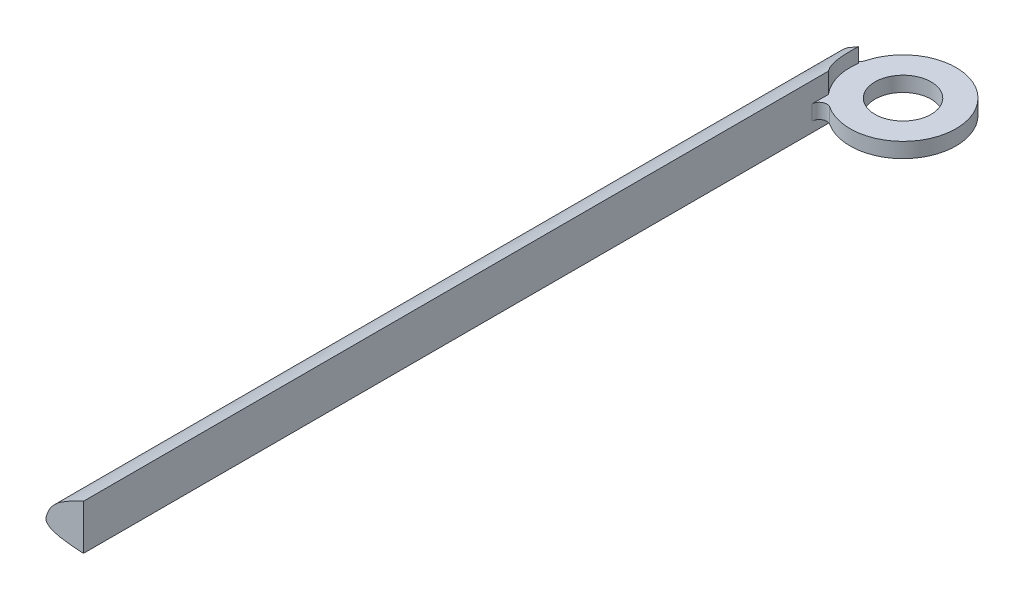
ISO-10303-21;
HEADER;
FILE_DESCRIPTION(('STEP AP214'),'2;1');
FILE_NAME('part.step','',(''),(''),'','','');
FILE_SCHEMA(('AUTOMOTIVE_DESIGN { 1 0 10303 214 1 1 1 1 }'));
ENDSEC;
DATA;
#1=APPLICATION_CONTEXT('core data for automotive mechanical design processes');
#2=APPLICATION_PROTOCOL_DEFINITION('international standard','automotive_design',2000,#1);
#3=PRODUCT_CONTEXT('',#1,'mechanical');
#4=PRODUCT('Part','Part','',(#3));
#5=PRODUCT_RELATED_PRODUCT_CATEGORY('part','',(#4));
#6=PRODUCT_DEFINITION_FORMATION('','',#4);
#7=PRODUCT_DEFINITION_CONTEXT('part definition',#1,'design');
#8=PRODUCT_DEFINITION('design','',#6,#7);
#9=PRODUCT_DEFINITION_SHAPE('','',#8);
#10=(LENGTH_UNIT() NAMED_UNIT(*) SI_UNIT(.MILLI.,.METRE.));
#11=(NAMED_UNIT(*) PLANE_ANGLE_UNIT() SI_UNIT($,.RADIAN.));
#12=(NAMED_UNIT(*) SI_UNIT($,.STERADIAN.) SOLID_ANGLE_UNIT());
#13=UNCERTAINTY_MEASURE_WITH_UNIT(LENGTH_MEASURE(1.E-05),#10,'distance_accuracy_value','');
#14=(GEOMETRIC_REPRESENTATION_CONTEXT(3) GLOBAL_UNCERTAINTY_ASSIGNED_CONTEXT((#13)) GLOBAL_UNIT_ASSIGNED_CONTEXT((#10,
#11,#12)) REPRESENTATION_CONTEXT('',''));
#15=CARTESIAN_POINT('',(0.,0.,0.));
#16=DIRECTION('',(0.,0.,1.));
#17=DIRECTION('',(1.,0.,0.));
#18=AXIS2_PLACEMENT_3D('',#15,#16,#17);
#19=CARTESIAN_POINT('',(12.7,0.,9.9645430734967));
#20=DIRECTION('',(-1.,0.,0.));
#21=DIRECTION('',(0.,0.,1.));
#22=AXIS2_PLACEMENT_3D('',#19,#20,#21);
#23=PLANE('',#22);
#24=DIRECTION('',(0.,1.,0.));
#25=VECTOR('',#24,1.);
#26=CARTESIAN_POINT('',(12.7,-3.39130956318596,24.2953156058815));
#27=LINE('',#26,#25);
#28=CARTESIAN_POINT('',(12.6999999993449,-3.39130956318596,24.2953156051066));
#29=VERTEX_POINT('',#28);
#30=CARTESIAN_POINT('',(12.7,0.,24.2953156058815));
#31=VERTEX_POINT('',#30);
#32=EDGE_CURVE('E201',#29,#31,#27,.T.);
#33=ORIENTED_EDGE('',*,*,#32,.T.);
#34=DIRECTION('',(0.,0.,1.));
#35=VECTOR('',#34,1.);
#36=CARTESIAN_POINT('',(12.7,0.,12.7));
#37=LINE('',#36,#35);
#38=CARTESIAN_POINT('',(12.7,0.,29.8862743545558));
#39=VERTEX_POINT('',#38);
#40=EDGE_CURVE('E60',#31,#39,#37,.T.);
#41=ORIENTED_EDGE('',*,*,#40,.T.);
#42=DIRECTION('',(0.,1.,0.));
#43=VECTOR('',#42,1.);
#44=CARTESIAN_POINT('',(12.7,5.08,29.8862743545558));
#45=LINE('',#44,#43);
#46=CARTESIAN_POINT('',(12.7,5.08,29.8862743545558));
#47=VERTEX_POINT('',#46);
#48=EDGE_CURVE('E281',#39,#47,#45,.T.);
#49=ORIENTED_EDGE('',*,*,#48,.T.);
#50=DIRECTION('',(0.,0.,-1.));
#51=VECTOR('',#50,1.);
#52=CARTESIAN_POINT('',(12.7,5.08,9.9645430734967));
#53=LINE('',#52,#51);
#54=CARTESIAN_POINT('',(12.7,5.08,24.2953156058815));
#55=VERTEX_POINT('',#54);
#56=EDGE_CURVE('E146',#47,#55,#53,.T.);
#57=ORIENTED_EDGE('',*,*,#56,.T.);
#58=DIRECTION('',(0.,-1.,0.));
#59=VECTOR('',#58,1.);
#60=CARTESIAN_POINT('',(12.7,11.9193673893497,24.2953156058815));
#61=LINE('',#60,#59);
#62=CARTESIAN_POINT('',(12.7,11.9193673893497,24.2953156058815));
#63=VERTEX_POINT('',#62);
#64=EDGE_CURVE('E133',#63,#55,#61,.T.);
#65=ORIENTED_EDGE('',*,*,#64,.F.);
#66=DIRECTION('',(0.,0.,1.));
#67=VECTOR('',#66,1.);
#68=CARTESIAN_POINT('',(12.7,11.9193673886914,9.9645430734967));
#69=LINE('',#68,#67);
#70=CARTESIAN_POINT('',(12.7,11.9193673886914,276.664543073497));
#71=VERTEX_POINT('',#70);
#72=EDGE_CURVE('E143',#63,#71,#69,.T.);
#73=ORIENTED_EDGE('',*,*,#72,.T.);
#74=DIRECTION('',(0.,-1.,0.));
#75=VECTOR('',#74,1.);
#76=CARTESIAN_POINT('',(12.7,0.,276.664543073497));
#77=LINE('',#76,#75);
#78=CARTESIAN_POINT('',(12.7,-3.39130956318595,276.664543073497));
#79=VERTEX_POINT('',#78);
#80=EDGE_CURVE('E219',#71,#79,#77,.T.);
#81=ORIENTED_EDGE('',*,*,#80,.T.);
#82=DIRECTION('',(0.,0.,1.));
#83=VECTOR('',#82,1.);
#84=CARTESIAN_POINT('',(12.7,-3.39130956318595,9.9645430734967));
#85=LINE('',#84,#83);
#86=EDGE_CURVE('E247',#29,#79,#85,.T.);
#87=ORIENTED_EDGE('',*,*,#86,.F.);
#88=EDGE_LOOP('',(#33,#41,#49,#57,#65,#73,#81,#87));
#89=FACE_BOUND('',#88,.T.);
#90=ADVANCED_FACE('F44',(#89),#23,.F.);
#91=CARTESIAN_POINT('',(163.3728,0.,9.9645430734967));
#92=CARTESIAN_POINT('',(163.383587059003,0.00751423817285132,9.9645430734967));
#93=CARTESIAN_POINT('',(163.01732505458,0.265748238940606,9.9645430734967));
#94=CARTESIAN_POINT('',(162.609173057159,0.422798752080663,9.9645430734967));
#95=CARTESIAN_POINT('',(161.677409800551,0.893518105061666,9.9645430734967));
#96=CARTESIAN_POINT('',(160.492747402865,1.37853599218307,9.9645430734967));
#97=CARTESIAN_POINT('',(158.934158943173,1.99299349433132,9.9645430734967));
#98=CARTESIAN_POINT('',(157.057898736523,2.65868782569382,9.9645430734967));
#99=CARTESIAN_POINT('',(154.850687721662,3.37645078076449,9.9645430734967));
#100=CARTESIAN_POINT('',(152.333818593458,4.14637497808863,9.9645430734967));
#101=CARTESIAN_POINT('',(149.512288629552,4.96027884299755,9.9645430734967));
#102=CARTESIAN_POINT('',(146.4050128806,5.83699037032611,9.9645430734967));
#103=CARTESIAN_POINT('',(143.014352544334,6.74271883988464,9.9645430734967));
#104=CARTESIAN_POINT('',(139.370608072715,7.72755201916778,9.9645430734967));
#105=CARTESIAN_POINT('',(135.469263436021,8.71313933022112,9.9645430734967));
#106=CARTESIAN_POINT('',(131.34978012743,9.76985404533989,9.9645430734967));
#107=CARTESIAN_POINT('',(127.003368634461,10.8001140879359,9.9645430734967));
#108=CARTESIAN_POINT('',(122.480324632155,11.913090560033,9.9645430734967));
#109=CARTESIAN_POINT('',(117.763343136897,12.9546465407067,9.9645430734967));
#110=CARTESIAN_POINT('',(112.914934001781,14.070673167375,9.9645430734967));
#111=CARTESIAN_POINT('',(107.907963700569,15.0385176744521,9.9645430734967));
#112=CARTESIAN_POINT('',(102.812498431816,16.0556812193166,9.9645430734967));
#113=CARTESIAN_POINT('',(97.6032287639258,16.8789727149063,9.9645430734967));
#114=CARTESIAN_POINT('',(92.3461316631343,17.72359548674,9.9645430734967));
#115=CARTESIAN_POINT('',(87.0232948465702,18.3286664621919,9.9645430734967));
#116=CARTESIAN_POINT('',(81.6955895322473,18.9583990145258,9.9645430734967));
#117=CARTESIAN_POINT('',(76.353194495239,19.3261280897353,9.9645430734967));
#118=CARTESIAN_POINT('',(71.0445122569591,19.7221463408476,9.9645430734967));
#119=CARTESIAN_POINT('',(65.7731773338067,19.8185659051508,9.9645430734967));
#120=CARTESIAN_POINT('',(60.5740112438955,19.9697706351892,9.9645430734967));
#121=CARTESIAN_POINT('',(55.4665475085545,19.8039017338967,9.9645430734967));
#122=CARTESIAN_POINT('',(50.4638042627736,19.7062237947174,9.9645430734967));
#123=CARTESIAN_POINT('',(45.6085392664175,19.2561357479536,9.9645430734967));
#124=CARTESIAN_POINT('',(40.8844110733503,18.8953146570012,9.9645430734967));
#125=CARTESIAN_POINT('',(36.3686592797738,18.1605558467497,9.9645430734967));
#126=CARTESIAN_POINT('',(32.0029387530543,17.5654928060039,9.9645430734967));
#127=CARTESIAN_POINT('',(27.9052262712561,16.6012988542017,9.9645430734967));
#128=CARTESIAN_POINT('',(23.9681817597894,15.8074130893288,9.9645430734967));
#129=CARTESIAN_POINT('',(20.3613553956287,14.6410507890504,9.9645430734967));
#130=CARTESIAN_POINT('',(16.9165744812227,13.678699684883,9.9645430734967));
#131=CARTESIAN_POINT('',(13.8692452701378,12.3524148239362,9.9645430734967));
#132=CARTESIAN_POINT('',(10.966663162502,11.2729140544838,9.9645430734967));
#133=CARTESIAN_POINT('',(8.5276061415999,9.84971764826019,9.9645430734967));
#134=CARTESIAN_POINT('',(6.27996437841128,8.64678560287924,9.9645430734967));
#135=CARTESIAN_POINT('',(4.34224258876067,7.40453424018926,9.9645430734967));
#136=CARTESIAN_POINT('',(2.80617361753247,5.99424744418782,9.9645430734967));
#137=CARTESIAN_POINT('',(1.51674091067302,4.53719147054603,9.9645430734967));
#138=CARTESIAN_POINT('',(0.712524385574345,2.96982774437296,9.9645430734967));
#139=CARTESIAN_POINT('',(0.165588018834602,1.50256591111099,9.9645430734967));
#140=CARTESIAN_POINT('',(-0.175789233061753,0.327544624215155,9.9645430734967));
#141=CARTESIAN_POINT('',(0.206959289608702,-0.498579461354857,9.9645430734967));
#142=CARTESIAN_POINT('',(0.79664848114686,-0.996478044368836,9.9645430734967));
#143=CARTESIAN_POINT('',(1.56272663932993,-1.75151036319057,9.9645430734967));
#144=CARTESIAN_POINT('',(2.90833434344813,-2.0480050450634,9.9645430734967));
#145=CARTESIAN_POINT('',(4.4045940590148,-2.61505597604704,9.9645430734967));
#146=CARTESIAN_POINT('',(6.33424031107069,-2.74845040506197,9.9645430734967));
#147=CARTESIAN_POINT('',(8.51495167423467,-3.15489129161403,9.9645430734967));
#148=CARTESIAN_POINT('',(11.0489505974797,-3.22732703009584,9.9645430734967));
#149=CARTESIAN_POINT('',(13.8584553542713,-3.52127467514997,9.9645430734967));
#150=CARTESIAN_POINT('',(16.9743032298416,-3.53571709132218,9.9645430734967));
#151=CARTESIAN_POINT('',(20.3571900216877,-3.73044274958051,9.9645430734967));
#152=CARTESIAN_POINT('',(24.0084359995763,-3.67387456719054,9.9645430734967));
#153=CARTESIAN_POINT('',(27.9046385930513,-3.75881566774831,9.9645430734967));
#154=CARTESIAN_POINT('',(32.0294409081121,-3.60612028222518,9.9645430734967));
#155=CARTESIAN_POINT('',(36.3707114399823,-3.5627219971114,9.9645430734967));
#156=CARTESIAN_POINT('',(40.9010645293092,-3.30651314562299,9.9645430734967));
#157=CARTESIAN_POINT('',(45.6131065499006,-3.12389238916172,9.9645430734967));
#158=CARTESIAN_POINT('',(50.4713376480519,-2.74598615510798,9.9645430734967));
#159=CARTESIAN_POINT('',(55.4715928923404,-2.40869899451157,9.9645430734967));
#160=CARTESIAN_POINT('',(60.5751894429963,-1.90103929886761,9.9645430734967));
#161=CARTESIAN_POINT('',(65.776667367392,-1.39873920091098,9.9645430734967));
#162=CARTESIAN_POINT('',(71.0405797258692,-0.79262179760565,9.9645430734967));
#163=CARTESIAN_POINT('',(76.3546854690506,-0.177933954517571,9.9645430734967));
#164=CARTESIAN_POINT('',(81.6859884551553,0.504441371035846,9.9645430734967));
#165=CARTESIAN_POINT('',(87.0201887492754,1.16957863430579,9.9645430734967));
#166=CARTESIAN_POINT('',(92.3301818134686,1.82640614131987,9.9645430734967));
#167=CARTESIAN_POINT('',(97.5987035349792,2.40770143258659,9.9645430734967));
#168=CARTESIAN_POINT('',(102.794201193885,2.97695494090187,9.9645430734967));
#169=CARTESIAN_POINT('',(107.904307008512,3.42756384958963,9.9645430734967));
#170=CARTESIAN_POINT('',(112.897874835488,3.84779346579388,9.9645430734967));
#171=CARTESIAN_POINT('',(117.761821538468,4.13786263122034,9.9645430734967));
#172=CARTESIAN_POINT('',(122.46943488994,4.37479073841993,9.9645430734967));
#173=CARTESIAN_POINT('',(127.00364571625,4.49534277188984,9.9645430734967));
#174=CARTESIAN_POINT('',(131.343139297641,4.54052760665104,9.9645430734967));
#175=CARTESIAN_POINT('',(135.470144151123,4.47726296891412,9.9645430734967));
#176=CARTESIAN_POINT('',(139.367410442816,4.32024700938054,9.9645430734967));
#177=CARTESIAN_POINT('',(143.017418886581,4.07128506240523,9.9645430734967));
#178=CARTESIAN_POINT('',(146.404885544076,3.75668779932712,9.9645430734967));
#179=CARTESIAN_POINT('',(149.514262185785,3.37756095345468,9.9645430734967));
#180=CARTESIAN_POINT('',(152.334608133993,2.9605065602643,9.9645430734967));
#181=CARTESIAN_POINT('',(154.852364181883,2.50799530206386,9.9645430734967));
#182=CARTESIAN_POINT('',(157.057311243966,2.02671624361784,9.9645430734967));
#183=CARTESIAN_POINT('',(158.935762762783,1.54985465750666,9.9645430734967));
#184=CARTESIAN_POINT('',(160.492581181518,1.06728896962004,9.9645430734967));
#185=CARTESIAN_POINT('',(161.673940480827,0.666423666198968,9.9645430734967));
#186=CARTESIAN_POINT('',(162.606777317201,0.300087374049791,9.9645430734967));
#187=CARTESIAN_POINT('',(163.008060619899,0.14899970756212,9.9645430734967));
#188=CARTESIAN_POINT('',(163.363659323131,-0.00636737251870985,9.9645430734967));
#189=CARTESIAN_POINT('',(163.3728,0.,9.9645430734967));
#190=B_SPLINE_CURVE_WITH_KNOTS('',3,(#91,#92,#93,#94,#95,#96,#97,#98,#99,#100,#101,#102,#103,
#104,#105,#106,#107,#108,#109,#110,#111,#112,#113,#114,#115,#116,#117,#118,#119,#120,#121,#122,
#123,#124,#125,#126,#127,#128,#129,#130,#131,#132,#133,#134,#135,#136,#137,#138,#139,#140,#141,
#142,#143,#144,#145,#146,#147,#148,#149,#150,#151,#152,#153,#154,#155,#156,#157,#158,#159,#160,
#161,#162,#163,#164,#165,#166,#167,#168,#169,#170,#171,#172,#173,#174,#175,#176,#177,#178,#179,
#180,#181,#182,#183,#184,#185,#186,#187,#188,#189),.UNSPECIFIED.,.T.,.F.,(4,1,1,1,1,1,1,1,1,1,1,
1,1,1,1,1,1,1,1,1,1,1,1,1,1,1,1,1,1,1,1,1,1,1,1,1,1,1,1,1,1,1,1,1,1,1,1,1,1,1,1,1,1,1,1,1,1,1,1,
1,1,1,1,1,1,1,1,1,1,1,1,1,1,1,1,1,1,1,1,1,1,1,1,1,1,1,1,1,1,1,1,1,1,1,1,1,4),(0.,
0.000652375800474001,0.00240344824305293,0.00525656825777616,0.00916576414525399,
0.0140967507887129,0.0200220121070894,0.0268963436763612,0.0347063828713069,0.0434144575923079,
0.0529900197240517,0.0633968094728075,0.0746012542197577,0.0865310302989372,0.099154299734113,
0.112392946202992,0.126224491561968,0.140544888717164,0.155318673337255,0.170431652347923,
0.185859272314617,0.201486855100767,0.21729337680491,0.233167489320596,0.249086100090761,
0.264958726174628,0.280747986632832,0.296380919150158,0.311801213814499,0.326956198280747,
0.34178274714053,0.356247564285208,0.370274835051458,0.383861908178782,0.396887692238994,
0.409401211668324,0.421252505987224,0.432540778472774,0.44306525269204,0.452987148289923,
0.462044499089512,0.470525623352609,0.478015713742355,0.484719935647003,0.490901449374763,
0.496493482376747,0.501934630302492,0.506331603851298,0.510717666514293,0.511954044649899,
0.514195842006017,0.517506907461632,0.521314719070869,0.526107089755545,0.531740962786565,
0.538337761174815,0.545822104103918,0.554208083816506,0.563431264261174,0.573484426850772,
0.584310043394845,0.595866543172384,0.608108296907278,0.620979221659939,0.634441733895477,
0.648424207084819,0.662880137047378,0.677739163464503,0.692957281121996,0.708452452705004,
0.724176515371476,0.740041983978664,0.755990469053507,0.771938352799948,0.787811293886201,
0.803535896442132,0.819040498411977,0.834255057735326,0.849121194519524,0.863570137224621,
0.877552378440428,0.891006015922545,0.903874254768139,0.916114355519662,0.927680383940068,
0.938530909249465,0.948621564264013,0.957908586509766,0.96636362872513,0.97395265018994,
0.980639894713798,0.986402982837544,0.991206560358905,0.995011197109476,0.997773025834374,
0.999447193494769,1.),.UNSPECIFIED.);
#191=DIRECTION('',(0.,0.,1.));
#192=VECTOR('',#191,1.);
#193=SURFACE_OF_LINEAR_EXTRUSION('',#190,#192);
#194=ORIENTED_EDGE('',*,*,#72,.F.);
#195=CARTESIAN_POINT('',(12.6999999505194,11.9193673697668,24.2953155473513));
#196=CARTESIAN_POINT('',(12.6179500550542,11.8867246128226,24.1982599219679));
#197=CARTESIAN_POINT('',(12.536892385023,11.8543305252717,24.1002874250721));
#198=CARTESIAN_POINT('',(12.3768141713411,11.7899404601995,23.9025639701651));
#199=CARTESIAN_POINT('',(12.2977936217405,11.7579444815155,23.8028130173498));
#200=CARTESIAN_POINT('',(12.0637882507752,11.6623728470347,23.5008742752351));
#201=CARTESIAN_POINT('',(11.9119415774658,11.5992458242842,23.2960974292538));
#202=CARTESIAN_POINT('',(11.6169640296919,11.4736579441892,22.8800585920038));
#203=CARTESIAN_POINT('',(11.4738361981,11.4111973256219,22.668794374898));
#204=CARTESIAN_POINT('',(11.1966384268698,11.286689609245,22.2402390981188));
#205=CARTESIAN_POINT('',(11.0625697703199,11.2246425711297,22.0229471908406));
#206=CARTESIAN_POINT('',(10.8029853957612,11.1006445427106,21.581428574126));
#207=CARTESIAN_POINT('',(10.6775257226538,11.0386963541858,21.3571681206556));
#208=CARTESIAN_POINT('',(10.4361552927408,10.916741251319,20.9030881287363));
#209=CARTESIAN_POINT('',(10.3202432290945,10.8567340719843,20.6732693566782));
#210=CARTESIAN_POINT('',(10.0981372601514,10.739848762355,20.2082444651462));
#211=CARTESIAN_POINT('',(9.99194176608081,10.6829701211162,19.9730392343139));
#212=CARTESIAN_POINT('',(9.78947612945665,10.5733217207137,19.4974626244004));
#213=CARTESIAN_POINT('',(9.69320583945963,10.5205519005145,19.2570913221278));
#214=CARTESIAN_POINT('',(9.48052179112395,10.4031704602712,18.6907421212586));
#215=CARTESIAN_POINT('',(9.36805361707046,10.3404554780007,18.3628745880718));
#216=CARTESIAN_POINT('',(9.16185930825928,10.225055783413,17.6995276892244));
#217=CARTESIAN_POINT('',(9.06813514739873,10.1723721275042,17.3640475260296));
#218=CARTESIAN_POINT('',(8.9000675487309,10.0778531100396,16.6867118368189));
#219=CARTESIAN_POINT('',(8.82572623032406,10.0360189348138,16.3448556179942));
#220=CARTESIAN_POINT('',(8.69727796780865,9.96381356701955,15.6577815852282));
#221=CARTESIAN_POINT('',(8.64308086554356,9.9333912931533,15.3125860217719));
#222=CARTESIAN_POINT('',(8.5548616418303,9.88393599853034,14.6188537727116));
#223=CARTESIAN_POINT('',(8.52083776394629,9.86490198622281,14.2703173806717));
#224=CARTESIAN_POINT('',(8.47323350447819,9.83828848252991,13.5715803051382));
#225=CARTESIAN_POINT('',(8.45964159062958,9.8307025295904,13.2213806724794));
#226=CARTESIAN_POINT('',(8.45475673823747,9.82797594588098,12.7089043430011));
#227=CARTESIAN_POINT('',(8.45540953430712,9.82834017598537,12.5466802607088));
#228=CARTESIAN_POINT('',(8.4611076099255,9.83152152153303,12.2223750159377));
#229=CARTESIAN_POINT('',(8.46615154744536,9.83433788754996,12.0602938249368));
#230=CARTESIAN_POINT('',(8.48062213643213,9.8424213350891,11.7364182276708));
#231=CARTESIAN_POINT('',(8.49004813039103,9.84768804894763,11.5746237820355));
#232=CARTESIAN_POINT('',(8.53651383497908,9.87366850006921,10.927791990765));
#233=CARTESIAN_POINT('',(8.59104880541451,9.90419372369418,10.4443507847813));
#234=CARTESIAN_POINT('',(8.66502043820554,9.94571594134705,9.96454307349671));
#235=B_SPLINE_CURVE_WITH_KNOTS('',3,(#195,#196,#197,#198,#199,#200,#201,#202,#203,#204,#205,
#206,#207,#208,#209,#210,#211,#212,#213,#214,#215,#216,#217,#218,#219,#220,#221,#222,#223,#224,
#225,#226,#227,#228,#229,#230,#231,#232,#233,#234),.UNSPECIFIED.,.F.,.F.,(4,2,2,2,2,2,2,2,2,2,2,
2,2,2,2,2,2,2,2,4),(0.,0.393631473360837,0.787261796877514,1.57491470701718,2.3628409511618,
3.15087855964819,3.94363669978717,4.73628614925078,5.52880575868264,6.32131359317409,
7.37733037764669,8.43345831079197,9.4897016769644,10.5411590731783,11.5925249079888,
12.6432971049436,13.1299134581707,13.6163811429858,14.1027758590415,15.5633157298467),.UNSPECIFIED.);
#236=CARTESIAN_POINT('',(8.66502043820553,9.94571594134554,9.9645430734967));
#237=VERTEX_POINT('',#236);
#238=EDGE_CURVE('E129',#63,#237,#235,.T.);
#239=ORIENTED_EDGE('',*,*,#238,.T.);
#240=CARTESIAN_POINT('',(0.,0.851361026245869,9.9645430734967));
#241=VERTEX_POINT('',#240);
#242=EDGE_CURVE('E165',#237,#241,#190,.T.);
#243=ORIENTED_EDGE('',*,*,#242,.T.);
#244=DIRECTION('',(0.,0.,1.));
#245=VECTOR('',#244,1.);
#246=CARTESIAN_POINT('',(0.,0.851361026245869,9.9645430734967));
#247=LINE('',#246,#245);
#248=CARTESIAN_POINT('',(0.,0.851361026245869,276.664543073497));
#249=VERTEX_POINT('',#248);
#250=EDGE_CURVE('E155',#241,#249,#247,.T.);
#251=ORIENTED_EDGE('',*,*,#250,.T.);
#252=CARTESIAN_POINT('',(163.3728,0.,276.664543073497));
#253=CARTESIAN_POINT('',(163.383587059003,0.00751423817285132,276.664543073497));
#254=CARTESIAN_POINT('',(163.01732505458,0.265748238940606,276.664543073497));
#255=CARTESIAN_POINT('',(162.609173057159,0.422798752080663,276.664543073497));
#256=CARTESIAN_POINT('',(161.677409800551,0.893518105061666,276.664543073497));
#257=CARTESIAN_POINT('',(160.492747402865,1.37853599218307,276.664543073497));
#258=CARTESIAN_POINT('',(158.934158943173,1.99299349433132,276.664543073497));
#259=CARTESIAN_POINT('',(157.057898736523,2.65868782569382,276.664543073497));
#260=CARTESIAN_POINT('',(154.850687721662,3.37645078076449,276.664543073497));
#261=CARTESIAN_POINT('',(152.333818593458,4.14637497808863,276.664543073497));
#262=CARTESIAN_POINT('',(149.512288629552,4.96027884299755,276.664543073497));
#263=CARTESIAN_POINT('',(146.4050128806,5.83699037032611,276.664543073497));
#264=CARTESIAN_POINT('',(143.014352544334,6.74271883988464,276.664543073497));
#265=CARTESIAN_POINT('',(139.370608072715,7.72755201916778,276.664543073497));
#266=CARTESIAN_POINT('',(135.469263436021,8.71313933022112,276.664543073497));
#267=CARTESIAN_POINT('',(131.34978012743,9.76985404533989,276.664543073497));
#268=CARTESIAN_POINT('',(127.003368634461,10.8001140879359,276.664543073497));
#269=CARTESIAN_POINT('',(122.480324632155,11.913090560033,276.664543073497));
#270=CARTESIAN_POINT('',(117.763343136897,12.9546465407067,276.664543073497));
#271=CARTESIAN_POINT('',(112.914934001781,14.070673167375,276.664543073497));
#272=CARTESIAN_POINT('',(107.907963700569,15.0385176744521,276.664543073497));
#273=CARTESIAN_POINT('',(102.812498431816,16.0556812193166,276.664543073497));
#274=CARTESIAN_POINT('',(97.6032287639258,16.8789727149063,276.664543073497));
#275=CARTESIAN_POINT('',(92.3461316631343,17.72359548674,276.664543073497));
#276=CARTESIAN_POINT('',(87.0232948465702,18.3286664621919,276.664543073497));
#277=CARTESIAN_POINT('',(81.6955895322473,18.9583990145258,276.664543073497));
#278=CARTESIAN_POINT('',(76.353194495239,19.3261280897353,276.664543073497));
#279=CARTESIAN_POINT('',(71.0445122569591,19.7221463408476,276.664543073497));
#280=CARTESIAN_POINT('',(65.7731773338067,19.8185659051508,276.664543073497));
#281=CARTESIAN_POINT('',(60.5740112438955,19.9697706351892,276.664543073497));
#282=CARTESIAN_POINT('',(55.4665475085545,19.8039017338967,276.664543073497));
#283=CARTESIAN_POINT('',(50.4638042627736,19.7062237947174,276.664543073497));
#284=CARTESIAN_POINT('',(45.6085392664175,19.2561357479536,276.664543073497));
#285=CARTESIAN_POINT('',(40.8844110733503,18.8953146570012,276.664543073497));
#286=CARTESIAN_POINT('',(36.3686592797738,18.1605558467497,276.664543073497));
#287=CARTESIAN_POINT('',(32.0029387530543,17.5654928060039,276.664543073497));
#288=CARTESIAN_POINT('',(27.9052262712561,16.6012988542017,276.664543073497));
#289=CARTESIAN_POINT('',(23.9681817597894,15.8074130893288,276.664543073497));
#290=CARTESIAN_POINT('',(20.3613553956287,14.6410507890504,276.664543073497));
#291=CARTESIAN_POINT('',(16.9165744812227,13.678699684883,276.664543073497));
#292=CARTESIAN_POINT('',(13.8692452701378,12.3524148239362,276.664543073497));
#293=CARTESIAN_POINT('',(10.966663162502,11.2729140544838,276.664543073497));
#294=CARTESIAN_POINT('',(8.5276061415999,9.84971764826019,276.664543073497));
#295=CARTESIAN_POINT('',(6.27996437841128,8.64678560287924,276.664543073497));
#296=CARTESIAN_POINT('',(4.34224258876067,7.40453424018926,276.664543073497));
#297=CARTESIAN_POINT('',(2.80617361753247,5.99424744418782,276.664543073497));
#298=CARTESIAN_POINT('',(1.51674091067302,4.53719147054603,276.664543073497));
#299=CARTESIAN_POINT('',(0.712524385574345,2.96982774437296,276.664543073497));
#300=CARTESIAN_POINT('',(0.165588018834602,1.50256591111099,276.664543073497));
#301=CARTESIAN_POINT('',(-0.175789233061753,0.327544624215155,276.664543073497));
#302=CARTESIAN_POINT('',(0.206959289608702,-0.498579461354857,276.664543073497));
#303=CARTESIAN_POINT('',(0.79664848114686,-0.996478044368836,276.664543073497));
#304=CARTESIAN_POINT('',(1.56272663932993,-1.75151036319057,276.664543073497));
#305=CARTESIAN_POINT('',(2.90833434344813,-2.0480050450634,276.664543073497));
#306=CARTESIAN_POINT('',(4.4045940590148,-2.61505597604704,276.664543073497));
#307=CARTESIAN_POINT('',(6.33424031107069,-2.74845040506197,276.664543073497));
#308=CARTESIAN_POINT('',(8.51495167423467,-3.15489129161403,276.664543073497));
#309=CARTESIAN_POINT('',(11.0489505974797,-3.22732703009584,276.664543073497));
#310=CARTESIAN_POINT('',(13.8584553542713,-3.52127467514997,276.664543073497));
#311=CARTESIAN_POINT('',(16.9743032298416,-3.53571709132218,276.664543073497));
#312=CARTESIAN_POINT('',(20.3571900216877,-3.73044274958051,276.664543073497));
#313=CARTESIAN_POINT('',(24.0084359995763,-3.67387456719054,276.664543073497));
#314=CARTESIAN_POINT('',(27.9046385930513,-3.75881566774831,276.664543073497));
#315=CARTESIAN_POINT('',(32.0294409081121,-3.60612028222518,276.664543073497));
#316=CARTESIAN_POINT('',(36.3707114399823,-3.5627219971114,276.664543073497));
#317=CARTESIAN_POINT('',(40.9010645293092,-3.30651314562299,276.664543073497));
#318=CARTESIAN_POINT('',(45.6131065499006,-3.12389238916172,276.664543073497));
#319=CARTESIAN_POINT('',(50.4713376480519,-2.74598615510798,276.664543073497));
#320=CARTESIAN_POINT('',(55.4715928923404,-2.40869899451157,276.664543073497));
#321=CARTESIAN_POINT('',(60.5751894429963,-1.90103929886761,276.664543073497));
#322=CARTESIAN_POINT('',(65.776667367392,-1.39873920091098,276.664543073497));
#323=CARTESIAN_POINT('',(71.0405797258692,-0.79262179760565,276.664543073497));
#324=CARTESIAN_POINT('',(76.3546854690506,-0.177933954517571,276.664543073497));
#325=CARTESIAN_POINT('',(81.6859884551553,0.504441371035846,276.664543073497));
#326=CARTESIAN_POINT('',(87.0201887492754,1.16957863430579,276.664543073497));
#327=CARTESIAN_POINT('',(92.3301818134686,1.82640614131987,276.664543073497));
#328=CARTESIAN_POINT('',(97.5987035349792,2.40770143258659,276.664543073497));
#329=CARTESIAN_POINT('',(102.794201193885,2.97695494090187,276.664543073497));
#330=CARTESIAN_POINT('',(107.904307008512,3.42756384958963,276.664543073497));
#331=CARTESIAN_POINT('',(112.897874835488,3.84779346579388,276.664543073497));
#332=CARTESIAN_POINT('',(117.761821538468,4.13786263122034,276.664543073497));
#333=CARTESIAN_POINT('',(122.46943488994,4.37479073841993,276.664543073497));
#334=CARTESIAN_POINT('',(127.00364571625,4.49534277188984,276.664543073497));
#335=CARTESIAN_POINT('',(131.343139297641,4.54052760665104,276.664543073497));
#336=CARTESIAN_POINT('',(135.470144151123,4.47726296891412,276.664543073497));
#337=CARTESIAN_POINT('',(139.367410442816,4.32024700938054,276.664543073497));
#338=CARTESIAN_POINT('',(143.017418886581,4.07128506240523,276.664543073497));
#339=CARTESIAN_POINT('',(146.404885544076,3.75668779932712,276.664543073497));
#340=CARTESIAN_POINT('',(149.514262185785,3.37756095345468,276.664543073497));
#341=CARTESIAN_POINT('',(152.334608133993,2.9605065602643,276.664543073497));
#342=CARTESIAN_POINT('',(154.852364181883,2.50799530206386,276.664543073497));
#343=CARTESIAN_POINT('',(157.057311243966,2.02671624361784,276.664543073497));
#344=CARTESIAN_POINT('',(158.935762762783,1.54985465750666,276.664543073497));
#345=CARTESIAN_POINT('',(160.492581181518,1.06728896962004,276.664543073497));
#346=CARTESIAN_POINT('',(161.673940480827,0.666423666198968,276.664543073497));
#347=CARTESIAN_POINT('',(162.606777317201,0.300087374049791,276.664543073497));
#348=CARTESIAN_POINT('',(163.008060619899,0.14899970756212,276.664543073497));
#349=CARTESIAN_POINT('',(163.363659323131,-0.00636737251870985,276.664543073497));
#350=CARTESIAN_POINT('',(163.3728,0.,276.664543073497));
#351=B_SPLINE_CURVE_WITH_KNOTS('',3,(#252,#253,#254,#255,#256,#257,#258,#259,#260,#261,#262,
#263,#264,#265,#266,#267,#268,#269,#270,#271,#272,#273,#274,#275,#276,#277,#278,#279,#280,#281,
#282,#283,#284,#285,#286,#287,#288,#289,#290,#291,#292,#293,#294,#295,#296,#297,#298,#299,#300,
#301,#302,#303,#304,#305,#306,#307,#308,#309,#310,#311,#312,#313,#314,#315,#316,#317,#318,#319,
#320,#321,#322,#323,#324,#325,#326,#327,#328,#329,#330,#331,#332,#333,#334,#335,#336,#337,#338,
#339,#340,#341,#342,#343,#344,#345,#346,#347,#348,#349,#350),.UNSPECIFIED.,.T.,.F.,(4,1,1,1,1,1,
1,1,1,1,1,1,1,1,1,1,1,1,1,1,1,1,1,1,1,1,1,1,1,1,1,1,1,1,1,1,1,1,1,1,1,1,1,1,1,1,1,1,1,1,1,1,1,1,
1,1,1,1,1,1,1,1,1,1,1,1,1,1,1,1,1,1,1,1,1,1,1,1,1,1,1,1,1,1,1,1,1,1,1,1,1,1,1,1,1,1,4),(0.,
0.000652375800474001,0.00240344824305293,0.00525656825777616,0.00916576414525399,
0.0140967507887129,0.0200220121070894,0.0268963436763612,0.0347063828713069,0.0434144575923079,
0.0529900197240517,0.0633968094728075,0.0746012542197577,0.0865310302989372,0.099154299734113,
0.112392946202992,0.126224491561968,0.140544888717164,0.155318673337255,0.170431652347923,
0.185859272314617,0.201486855100767,0.21729337680491,0.233167489320596,0.249086100090761,
0.264958726174628,0.280747986632832,0.296380919150158,0.311801213814499,0.326956198280747,
0.34178274714053,0.356247564285208,0.370274835051458,0.383861908178782,0.396887692238994,
0.409401211668324,0.421252505987224,0.432540778472774,0.44306525269204,0.452987148289923,
0.462044499089512,0.470525623352609,0.478015713742355,0.484719935647003,0.490901449374763,
0.496493482376747,0.501934630302492,0.506331603851298,0.510717666514293,0.511954044649899,
0.514195842006017,0.517506907461632,0.521314719070869,0.526107089755545,0.531740962786565,
0.538337761174815,0.545822104103918,0.554208083816506,0.563431264261174,0.573484426850772,
0.584310043394845,0.595866543172384,0.608108296907278,0.620979221659939,0.634441733895477,
0.648424207084819,0.662880137047378,0.677739163464503,0.692957281121996,0.708452452705004,
0.724176515371476,0.740041983978664,0.755990469053507,0.771938352799948,0.787811293886201,
0.803535896442132,0.819040498411977,0.834255057735326,0.849121194519524,0.863570137224621,
0.877552378440428,0.891006015922545,0.903874254768139,0.916114355519662,0.927680383940068,
0.938530909249465,0.948621564264013,0.957908586509766,0.96636362872513,0.97395265018994,
0.980639894713798,0.986402982837544,0.991206560358905,0.995011197109476,0.997773025834374,
0.999447193494769,1.),.UNSPECIFIED.);
#352=EDGE_CURVE('E152',#71,#249,#351,.T.);
#353=ORIENTED_EDGE('',*,*,#352,.F.);
#354=EDGE_LOOP('',(#194,#239,#243,#251,#353));
#355=FACE_BOUND('',#354,.T.);
#356=ADVANCED_FACE('F150',(#355),#193,.T.);
#357=CARTESIAN_POINT('',(0.,0.,9.9645430734967));
#358=DIRECTION('',(0.,0.,1.));
#359=DIRECTION('',(1.,0.,0.));
#360=AXIS2_PLACEMENT_3D('',#357,#358,#359);
#361=PLANE('',#360);
#362=DIRECTION('',(0.,-1.,0.));
#363=VECTOR('',#362,1.);
#364=CARTESIAN_POINT('',(8.66502043820553,11.9193673893497,9.9645430734967));
#365=LINE('',#364,#363);
#366=CARTESIAN_POINT('',(8.66502043820553,5.08,9.9645430734967));
#367=VERTEX_POINT('',#366);
#368=EDGE_CURVE('E134',#237,#367,#365,.T.);
#369=ORIENTED_EDGE('',*,*,#368,.T.);
#370=DIRECTION('',(-1.,0.,0.));
#371=VECTOR('',#370,1.);
#372=CARTESIAN_POINT('',(0.,5.08,9.9645430734967));
#373=LINE('',#372,#371);
#374=CARTESIAN_POINT('',(6.60588752160476,5.08,9.9645430734967));
#375=VERTEX_POINT('',#374);
#376=EDGE_CURVE('E68',#367,#375,#373,.T.);
#377=ORIENTED_EDGE('',*,*,#376,.T.);
#378=DIRECTION('',(0.,1.,0.));
#379=VECTOR('',#378,1.);
#380=CARTESIAN_POINT('',(6.60588752160476,0.,9.9645430734967));
#381=LINE('',#380,#379);
#382=CARTESIAN_POINT('',(6.60588752160476,0.,9.9645430734967));
#383=VERTEX_POINT('',#382);
#384=EDGE_CURVE('E301',#375,#383,#381,.F.);
#385=ORIENTED_EDGE('',*,*,#384,.T.);
#386=DIRECTION('',(1.,0.,0.));
#387=VECTOR('',#386,1.);
#388=CARTESIAN_POINT('',(26.416,0.,9.9645430734967));
#389=LINE('',#388,#387);
#390=CARTESIAN_POINT('',(8.66502043820553,0.,9.9645430734967));
#391=VERTEX_POINT('',#390);
#392=EDGE_CURVE('E295',#383,#391,#389,.T.);
#393=ORIENTED_EDGE('',*,*,#392,.T.);
#394=DIRECTION('',(0.,1.,0.));
#395=VECTOR('',#394,1.);
#396=CARTESIAN_POINT('',(8.66502043820553,-3.39130956318596,9.9645430734967));
#397=LINE('',#396,#395);
#398=CARTESIAN_POINT('',(8.66502043820553,-3.10795923964405,9.9645430734967));
#399=VERTEX_POINT('',#398);
#400=EDGE_CURVE('E202',#391,#399,#397,.F.);
#401=ORIENTED_EDGE('',*,*,#400,.T.);
#402=CARTESIAN_POINT('',(0.,0.,9.9645430734967));
#403=VERTEX_POINT('',#402);
#404=EDGE_CURVE('E156',#403,#399,#190,.T.);
#405=ORIENTED_EDGE('',*,*,#404,.F.);
#406=DIRECTION('',(0.,1.,0.));
#407=VECTOR('',#406,1.);
#408=CARTESIAN_POINT('',(0.,0.,9.9645430734967));
#409=LINE('',#408,#407);
#410=EDGE_CURVE('E163',#403,#241,#409,.T.);
#411=ORIENTED_EDGE('',*,*,#410,.T.);
#412=ORIENTED_EDGE('',*,*,#242,.F.);
#413=EDGE_LOOP('',(#369,#377,#385,#393,#401,#405,#411,#412));
#414=FACE_BOUND('',#413,.T.);
#415=ADVANCED_FACE('F322',(#414),#361,.F.);
#416=CARTESIAN_POINT('',(12.6999999993449,-3.39130956313331,24.2953156051066));
#417=CARTESIAN_POINT('',(12.59197181293,-3.38262073504254,24.1675305195339));
#418=CARTESIAN_POINT('',(12.4857308395194,-3.37391278970805,24.0382363829237));
#419=CARTESIAN_POINT('',(12.276896530817,-3.35668943947453,23.7767211271205));
#420=CARTESIAN_POINT('',(12.1743032213452,-3.34817403593858,23.6444999872193));
#421=CARTESIAN_POINT('',(11.9728532872739,-3.33156785282765,23.3772426316314));
#422=CARTESIAN_POINT('',(11.8739961341511,-3.32347701312974,23.2422068183381));
#423=CARTESIAN_POINT('',(11.6800816612994,-3.30788803750375,22.9694070398981));
#424=CARTESIAN_POINT('',(11.5850243327273,-3.30038990019624,22.8316430811017));
#425=CARTESIAN_POINT('',(11.3056747899384,-3.27900178404907,22.414426442814));
#426=CARTESIAN_POINT('',(11.1271716680565,-3.26621525631468,22.1310047558042));
#427=CARTESIAN_POINT('',(10.7862347394718,-3.24415099449896,21.5545242293153));
#428=CARTESIAN_POINT('',(10.6238019928342,-3.23487349177291,21.2614647557866));
#429=CARTESIAN_POINT('',(10.3155592345727,-3.217917457591,20.6666806973749));
#430=CARTESIAN_POINT('',(10.1697493477403,-3.21023893813869,20.364956047462));
#431=CARTESIAN_POINT('',(9.89522972374505,-3.19543981951668,19.753819019446));
#432=CARTESIAN_POINT('',(9.76651973132804,-3.18831921201955,19.4444067561797));
#433=CARTESIAN_POINT('',(9.5263316746425,-3.17419154591374,18.8181556698698));
#434=CARTESIAN_POINT('',(9.4148933676433,-3.16718478156911,18.5013015904904));
#435=CARTESIAN_POINT('',(9.20994822286104,-3.15333396593757,17.8618327034878));
#436=CARTESIAN_POINT('',(9.11644191424282,-3.14648991945759,17.5392177261703));
#437=CARTESIAN_POINT('',(8.94765054839221,-3.13329122907783,16.8892154421133));
#438=CARTESIAN_POINT('',(8.87236709535479,-3.1269366282985,16.561827717907));
#439=CARTESIAN_POINT('',(8.74034914287305,-3.11519631431602,15.9037261510274));
#440=CARTESIAN_POINT('',(8.68359239116811,-3.10980944230681,15.5730167939616));
#441=CARTESIAN_POINT('',(8.58868896016275,-3.10047743051969,14.9089522759945));
#442=CARTESIAN_POINT('',(8.55054048001202,-3.09653215123822,14.5755973742951));
#443=CARTESIAN_POINT('',(8.49297897136183,-3.09047198323635,13.907365492829));
#444=CARTESIAN_POINT('',(8.47355946438675,-3.08835646161684,13.5724890796631));
#445=CARTESIAN_POINT('',(8.45533572309083,-3.08636828252711,12.9636628208701));
#446=CARTESIAN_POINT('',(8.45340377913937,-3.08615543458815,12.6898030490535));
#447=CARTESIAN_POINT('',(8.46206137999864,-3.08710258982462,12.1422840832717));
#448=CARTESIAN_POINT('',(8.47265068667424,-3.08826256689101,11.868624885591));
#449=CARTESIAN_POINT('',(8.50630840407089,-3.09187723401381,11.3224256585771));
#450=CARTESIAN_POINT('',(8.52936133589677,-3.09433031803332,11.049884662658));
#451=CARTESIAN_POINT('',(8.58788722783979,-3.10035234657897,10.5060901202653));
#452=CARTESIAN_POINT('',(8.62336296517522,-3.1039215406014,10.2348368754339));
#453=CARTESIAN_POINT('',(8.66502043820554,-3.10795924033791,9.9645430734967));
#454=B_SPLINE_CURVE_WITH_KNOTS('',3,(#416,#417,#418,#419,#420,#421,#422,#423,#424,#425,#426,
#427,#428,#429,#430,#431,#432,#433,#434,#435,#436,#437,#438,#439,#440,#441,#442,#443,#444,#445,
#446,#447,#448,#449,#450,#451,#452,#453),.UNSPECIFIED.,.F.,.F.,(4,2,2,2,2,2,2,2,2,2,2,2,2,2,2,2,
2,2,4),(0.,0.502647224739643,1.00529800678346,1.5078774147707,2.01045565304069,3.01544592671777,
4.02050244936357,5.0255665166905,6.03061557950484,7.03794483795013,8.04530381763535,
9.05275144495078,10.0589845447182,11.0651202450642,12.0709077914644,12.8922298302956,
13.7135362490832,14.5338250016115,15.3542972534976),.UNSPECIFIED.);
#455=EDGE_CURVE('E193',#29,#399,#454,.T.);
#456=ORIENTED_EDGE('',*,*,#455,.F.);
#457=ORIENTED_EDGE('',*,*,#86,.T.);
#458=CARTESIAN_POINT('',(0.,0.,276.664543073497));
#459=VERTEX_POINT('',#458);
#460=EDGE_CURVE('E230',#459,#79,#351,.T.);
#461=ORIENTED_EDGE('',*,*,#460,.F.);
#462=DIRECTION('',(0.,0.,1.));
#463=VECTOR('',#462,1.);
#464=CARTESIAN_POINT('',(0.,0.,9.9645430734967));
#465=LINE('',#464,#463);
#466=EDGE_CURVE('E160',#403,#459,#465,.T.);
#467=ORIENTED_EDGE('',*,*,#466,.F.);
#468=ORIENTED_EDGE('',*,*,#404,.T.);
#469=EDGE_LOOP('',(#456,#457,#461,#467,#468));
#470=FACE_BOUND('',#469,.T.);
#471=ADVANCED_FACE('F177',(#470),#193,.T.);
#472=CARTESIAN_POINT('',(0.,0.,9.9645430734967));
#473=DIRECTION('',(1.,0.,0.));
#474=DIRECTION('',(0.,0.,-1.));
#475=AXIS2_PLACEMENT_3D('',#472,#473,#474);
#476=PLANE('',#475);
#477=ORIENTED_EDGE('',*,*,#466,.T.);
#478=DIRECTION('',(0.,1.,0.));
#479=VECTOR('',#478,1.);
#480=CARTESIAN_POINT('',(0.,0.,276.664543073497));
#481=LINE('',#480,#479);
#482=EDGE_CURVE('E229',#459,#249,#481,.T.);
#483=ORIENTED_EDGE('',*,*,#482,.T.);
#484=ORIENTED_EDGE('',*,*,#250,.F.);
#485=ORIENTED_EDGE('',*,*,#410,.F.);
#486=EDGE_LOOP('',(#477,#483,#484,#485));
#487=FACE_BOUND('',#486,.T.);
#488=ADVANCED_FACE('F255',(#487),#476,.F.);
#489=CARTESIAN_POINT('',(0.,0.,276.664543073497));
#490=DIRECTION('',(0.,0.,1.));
#491=DIRECTION('',(1.,0.,0.));
#492=AXIS2_PLACEMENT_3D('',#489,#490,#491);
#493=PLANE('',#492);
#494=ORIENTED_EDGE('',*,*,#80,.F.);
#495=ORIENTED_EDGE('',*,*,#352,.T.);
#496=ORIENTED_EDGE('',*,*,#482,.F.);
#497=ORIENTED_EDGE('',*,*,#460,.T.);
#498=EDGE_LOOP('',(#494,#495,#496,#497));
#499=FACE_BOUND('',#498,.T.);
#500=ADVANCED_FACE('F265',(#499),#493,.T.);
#501=CARTESIAN_POINT('',(26.416,5.08,12.7));
#502=DIRECTION('',(0.,1.,0.));
#503=DIRECTION('',(0.,0.,1.));
#504=AXIS2_PLACEMENT_3D('',#501,#502,#503);
#505=PLANE('',#504);
#506=CARTESIAN_POINT('',(26.416,5.08,12.7));
#507=DIRECTION('',(0.,1.,0.));
#508=DIRECTION('',(0.,0.,1.));
#509=AXIS2_PLACEMENT_3D('',#506,#507,#508);
#510=CIRCLE('',#509,17.9605122421383);
#511=EDGE_CURVE('E148',#367,#55,#510,.T.);
#512=ORIENTED_EDGE('',*,*,#511,.T.);
#513=ORIENTED_EDGE('',*,*,#56,.F.);
#514=CARTESIAN_POINT('',(15.24,5.08,29.8862743545558));
#515=DIRECTION('',(0.,1.,0.));
#516=DIRECTION('',(0.,0.,1.));
#517=AXIS2_PLACEMENT_3D('',#514,#515,#516);
#518=CIRCLE('',#517,2.54);
#519=CARTESIAN_POINT('',(16.6246990584777,5.08,27.7569062517021));
#520=VERTEX_POINT('',#519);
#521=EDGE_CURVE('E11',#47,#520,#518,.F.);
#522=ORIENTED_EDGE('',*,*,#521,.T.);
#523=CARTESIAN_POINT('',(26.416,5.08,12.7));
#524=DIRECTION('',(0.,1.,0.));
#525=DIRECTION('',(0.,0.,1.));
#526=AXIS2_PLACEMENT_3D('',#523,#524,#525);
#527=CIRCLE('',#526,17.9605122421383);
#528=CARTESIAN_POINT('',(9.06034744440108,5.08,8.07816872123909));
#529=VERTEX_POINT('',#528);
#530=EDGE_CURVE('E215',#520,#529,#527,.T.);
#531=ORIENTED_EDGE('',*,*,#530,.T.);
#532=CARTESIAN_POINT('',(6.60588752160476,5.08,7.4245430734967));
#533=DIRECTION('',(0.,1.,0.));
#534=DIRECTION('',(0.,0.,1.));
#535=AXIS2_PLACEMENT_3D('',#532,#533,#534);
#536=CIRCLE('',#535,2.54);
#537=EDGE_CURVE('E309',#529,#375,#536,.F.);
#538=ORIENTED_EDGE('',*,*,#537,.T.);
#539=ORIENTED_EDGE('',*,*,#376,.F.);
#540=EDGE_LOOP('',(#512,#513,#522,#531,#538,#539));
#541=FACE_BOUND('',#540,.T.);
#542=CARTESIAN_POINT('',(26.416,5.08,12.7));
#543=DIRECTION('',(0.,1.,0.));
#544=DIRECTION('',(0.,0.,1.));
#545=AXIS2_PLACEMENT_3D('',#542,#543,#544);
#546=CIRCLE('',#545,9.525);
#547=CARTESIAN_POINT('',(26.416,5.08,22.225));
#548=VERTEX_POINT('',#547);
#549=EDGE_CURVE('E207',#548,#548,#546,.T.);
#550=ORIENTED_EDGE('',*,*,#549,.F.);
#551=EDGE_LOOP('',(#550));
#552=FACE_BOUND('',#551,.T.);
#553=ADVANCED_FACE('F276',(#541,#552),#505,.T.);
#554=CARTESIAN_POINT('',(26.416,0.,12.7));
#555=DIRECTION('',(0.,1.,0.));
#556=DIRECTION('',(0.,0.,1.));
#557=AXIS2_PLACEMENT_3D('',#554,#555,#556);
#558=PLANE('',#557);
#559=CARTESIAN_POINT('',(26.416,0.,12.7));
#560=DIRECTION('',(0.,1.,0.));
#561=DIRECTION('',(0.,0.,1.));
#562=AXIS2_PLACEMENT_3D('',#559,#560,#561);
#563=CIRCLE('',#562,9.525);
#564=CARTESIAN_POINT('',(26.416,0.,22.225));
#565=VERTEX_POINT('',#564);
#566=EDGE_CURVE('E206',#565,#565,#563,.T.);
#567=ORIENTED_EDGE('',*,*,#566,.T.);
#568=EDGE_LOOP('',(#567));
#569=FACE_BOUND('',#568,.T.);
#570=CARTESIAN_POINT('',(26.416,0.,12.7));
#571=DIRECTION('',(0.,1.,0.));
#572=DIRECTION('',(0.,0.,1.));
#573=AXIS2_PLACEMENT_3D('',#570,#571,#572);
#574=CIRCLE('',#573,17.9605122421383);
#575=CARTESIAN_POINT('',(16.6246990584777,0.,27.7569062517021));
#576=VERTEX_POINT('',#575);
#577=CARTESIAN_POINT('',(9.06034744440108,0.,8.07816872123909));
#578=VERTEX_POINT('',#577);
#579=EDGE_CURVE('E211',#576,#578,#574,.T.);
#580=ORIENTED_EDGE('',*,*,#579,.F.);
#581=CARTESIAN_POINT('',(15.24,0.,29.8862743545558));
#582=DIRECTION('',(0.,1.,0.));
#583=DIRECTION('',(0.,0.,1.));
#584=AXIS2_PLACEMENT_3D('',#581,#582,#583);
#585=CIRCLE('',#584,2.54);
#586=EDGE_CURVE('E53',#576,#39,#585,.T.);
#587=ORIENTED_EDGE('',*,*,#586,.T.);
#588=ORIENTED_EDGE('',*,*,#40,.F.);
#589=CARTESIAN_POINT('',(26.416,0.,12.7));
#590=DIRECTION('',(0.,1.,0.));
#591=DIRECTION('',(0.,0.,1.));
#592=AXIS2_PLACEMENT_3D('',#589,#590,#591);
#593=CIRCLE('',#592,17.9605122421383);
#594=EDGE_CURVE('E139',#391,#31,#593,.T.);
#595=ORIENTED_EDGE('',*,*,#594,.F.);
#596=ORIENTED_EDGE('',*,*,#392,.F.);
#597=CARTESIAN_POINT('',(6.60588752160476,0.,7.4245430734967));
#598=DIRECTION('',(0.,1.,0.));
#599=DIRECTION('',(0.,0.,1.));
#600=AXIS2_PLACEMENT_3D('',#597,#598,#599);
#601=CIRCLE('',#600,2.54);
#602=EDGE_CURVE('E312',#383,#578,#601,.T.);
#603=ORIENTED_EDGE('',*,*,#602,.T.);
#604=EDGE_LOOP('',(#580,#587,#588,#595,#596,#603));
#605=FACE_BOUND('',#604,.T.);
#606=ADVANCED_FACE('F315',(#569,#605),#558,.F.);
#607=CARTESIAN_POINT('',(26.416,5.08,12.7));
#608=DIRECTION('',(0.,-1.,0.));
#609=DIRECTION('',(0.,0.,-1.));
#610=AXIS2_PLACEMENT_3D('',#607,#608,#609);
#611=CYLINDRICAL_SURFACE('',#610,17.9605122421383);
#612=ORIENTED_EDGE('',*,*,#579,.T.);
#613=DIRECTION('',(0.,-1.,0.));
#614=VECTOR('',#613,1.);
#615=CARTESIAN_POINT('',(9.06034744440108,5.08,8.07816872123909));
#616=LINE('',#615,#614);
#617=EDGE_CURVE('E291',#578,#529,#616,.F.);
#618=ORIENTED_EDGE('',*,*,#617,.T.);
#619=ORIENTED_EDGE('',*,*,#530,.F.);
#620=DIRECTION('',(0.,-1.,0.));
#621=VECTOR('',#620,1.);
#622=CARTESIAN_POINT('',(16.6246990584777,5.08,27.7569062517021));
#623=LINE('',#622,#621);
#624=EDGE_CURVE('E250',#520,#576,#623,.T.);
#625=ORIENTED_EDGE('',*,*,#624,.T.);
#626=EDGE_LOOP('',(#612,#618,#619,#625));
#627=FACE_BOUND('',#626,.T.);
#628=ADVANCED_FACE('F318',(#627),#611,.T.);
#629=CARTESIAN_POINT('',(26.416,5.08,12.7));
#630=DIRECTION('',(0.,-1.,0.));
#631=DIRECTION('',(0.,0.,-1.));
#632=AXIS2_PLACEMENT_3D('',#629,#630,#631);
#633=CYLINDRICAL_SURFACE('',#632,9.525);
#634=ORIENTED_EDGE('',*,*,#549,.T.);
#635=EDGE_LOOP('',(#634));
#636=FACE_BOUND('',#635,.T.);
#637=ORIENTED_EDGE('',*,*,#566,.F.);
#638=EDGE_LOOP('',(#637));
#639=FACE_BOUND('',#638,.T.);
#640=ADVANCED_FACE('F189',(#636,#639),#633,.F.);
#641=CARTESIAN_POINT('',(26.416,-3.39130956318596,12.7));
#642=DIRECTION('',(0.,1.,0.));
#643=DIRECTION('',(0.,0.,1.));
#644=AXIS2_PLACEMENT_3D('',#641,#642,#643);
#645=CYLINDRICAL_SURFACE('',#644,17.9605122421383);
#646=ORIENTED_EDGE('',*,*,#455,.T.);
#647=ORIENTED_EDGE('',*,*,#400,.F.);
#648=ORIENTED_EDGE('',*,*,#594,.T.);
#649=ORIENTED_EDGE('',*,*,#32,.F.);
#650=EDGE_LOOP('',(#646,#647,#648,#649));
#651=FACE_BOUND('',#650,.T.);
#652=ADVANCED_FACE('F185',(#651),#645,.F.);
#653=CARTESIAN_POINT('',(26.416,11.9193673893497,12.7));
#654=DIRECTION('',(0.,-1.,0.));
#655=DIRECTION('',(0.,0.,-1.));
#656=AXIS2_PLACEMENT_3D('',#653,#654,#655);
#657=CYLINDRICAL_SURFACE('',#656,17.9605122421383);
#658=ORIENTED_EDGE('',*,*,#64,.T.);
#659=ORIENTED_EDGE('',*,*,#511,.F.);
#660=ORIENTED_EDGE('',*,*,#368,.F.);
#661=ORIENTED_EDGE('',*,*,#238,.F.);
#662=EDGE_LOOP('',(#658,#659,#660,#661));
#663=FACE_BOUND('',#662,.T.);
#664=ADVANCED_FACE('F131',(#663),#657,.F.);
#665=CARTESIAN_POINT('',(6.60588752160476,5.08,7.4245430734967));
#666=DIRECTION('',(0.,-1.,0.));
#667=DIRECTION('',(0.,0.,-1.));
#668=AXIS2_PLACEMENT_3D('',#665,#666,#667);
#669=CYLINDRICAL_SURFACE('',#668,2.54);
#670=ORIENTED_EDGE('',*,*,#602,.F.);
#671=ORIENTED_EDGE('',*,*,#384,.F.);
#672=ORIENTED_EDGE('',*,*,#537,.F.);
#673=ORIENTED_EDGE('',*,*,#617,.F.);
#674=EDGE_LOOP('',(#670,#671,#672,#673));
#675=FACE_BOUND('',#674,.T.);
#676=ADVANCED_FACE('F184',(#675),#669,.F.);
#677=CARTESIAN_POINT('',(15.24,5.08,29.8862743545558));
#678=DIRECTION('',(0.,-1.,0.));
#679=DIRECTION('',(0.,0.,-1.));
#680=AXIS2_PLACEMENT_3D('',#677,#678,#679);
#681=CYLINDRICAL_SURFACE('',#680,2.54);
#682=ORIENTED_EDGE('',*,*,#521,.F.);
#683=ORIENTED_EDGE('',*,*,#48,.F.);
#684=ORIENTED_EDGE('',*,*,#586,.F.);
#685=ORIENTED_EDGE('',*,*,#624,.F.);
#686=EDGE_LOOP('',(#682,#683,#684,#685));
#687=FACE_BOUND('',#686,.T.);
#688=ADVANCED_FACE('F46',(#687),#681,.F.);
#689=CLOSED_SHELL('',(#90,#356,#415,#471,#488,#500,#553,#606,#628,#640,#652,#664,#676,#688));
#690=MANIFOLD_SOLID_BREP('B2',#689);
#691=ADVANCED_BREP_SHAPE_REPRESENTATION('',(#18,#690),#14);
#692=SHAPE_DEFINITION_REPRESENTATION(#9,#691);
ENDSEC;
END-ISO-10303-21;
